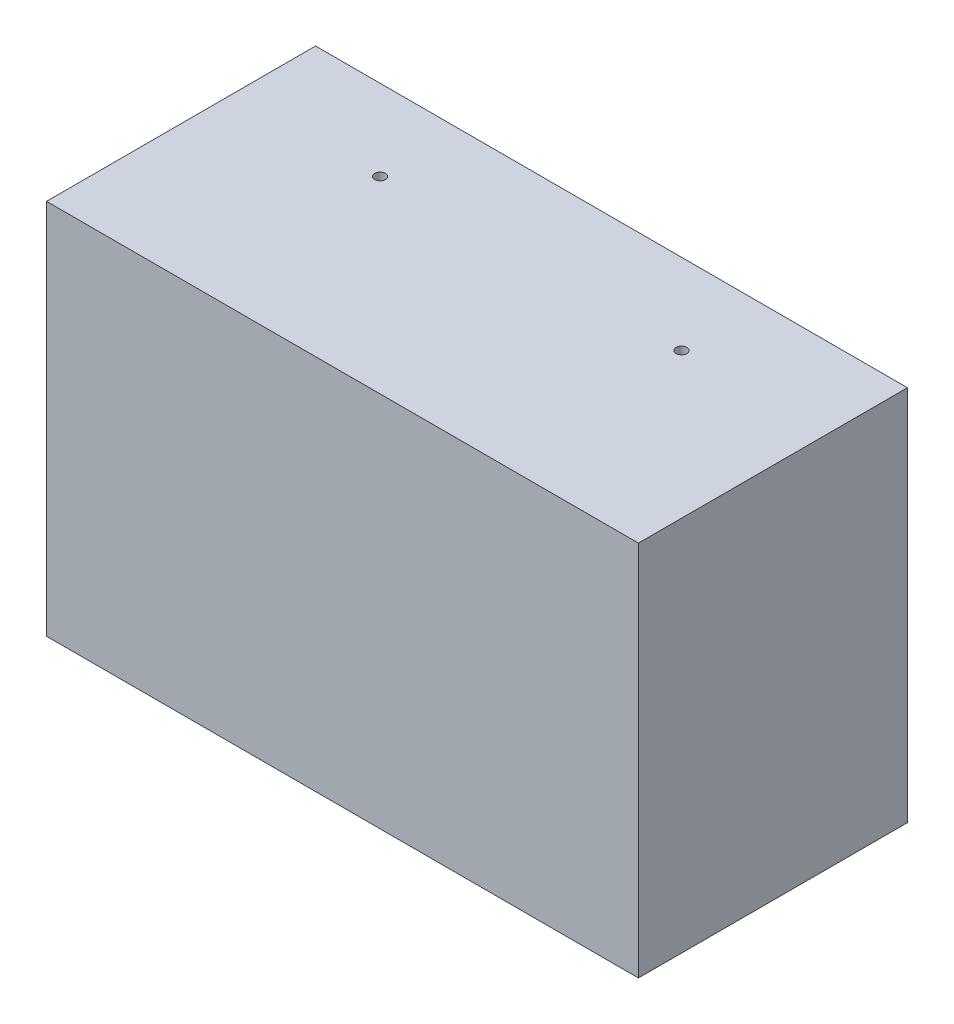
ISO-10303-21;
HEADER;
FILE_DESCRIPTION(('STEP AP214'),'2;1');
FILE_NAME('part.step','',(''),(''),'','','');
FILE_SCHEMA(('AUTOMOTIVE_DESIGN { 1 0 10303 214 1 1 1 1 }'));
ENDSEC;
DATA;
#1=APPLICATION_CONTEXT('core data for automotive mechanical design processes');
#2=APPLICATION_PROTOCOL_DEFINITION('international standard','automotive_design',2000,#1);
#3=PRODUCT_CONTEXT('',#1,'mechanical');
#4=PRODUCT('Part','Part','',(#3));
#5=PRODUCT_RELATED_PRODUCT_CATEGORY('part','',(#4));
#6=PRODUCT_DEFINITION_FORMATION('','',#4);
#7=PRODUCT_DEFINITION_CONTEXT('part definition',#1,'design');
#8=PRODUCT_DEFINITION('design','',#6,#7);
#9=PRODUCT_DEFINITION_SHAPE('','',#8);
#10=(LENGTH_UNIT() NAMED_UNIT(*) SI_UNIT(.MILLI.,.METRE.));
#11=(NAMED_UNIT(*) PLANE_ANGLE_UNIT() SI_UNIT($,.RADIAN.));
#12=(NAMED_UNIT(*) SI_UNIT($,.STERADIAN.) SOLID_ANGLE_UNIT());
#13=UNCERTAINTY_MEASURE_WITH_UNIT(LENGTH_MEASURE(1.E-05),#10,'distance_accuracy_value','');
#14=(GEOMETRIC_REPRESENTATION_CONTEXT(3) GLOBAL_UNCERTAINTY_ASSIGNED_CONTEXT((#13)) GLOBAL_UNIT_ASSIGNED_CONTEXT((#10,
#11,#12)) REPRESENTATION_CONTEXT('',''));
#15=CARTESIAN_POINT('',(0.,0.,0.));
#16=DIRECTION('',(0.,0.,1.));
#17=DIRECTION('',(1.,0.,0.));
#18=AXIS2_PLACEMENT_3D('',#15,#16,#17);
#19=CARTESIAN_POINT('',(-55.,-35.,50.));
#20=DIRECTION('',(0.,1.,0.));
#21=DIRECTION('',(0.,0.,1.));
#22=AXIS2_PLACEMENT_3D('',#19,#20,#21);
#23=PLANE('',#22);
#24=CARTESIAN_POINT('',(28.,-35.,15.));
#25=DIRECTION('',(0.,1.,0.));
#26=DIRECTION('',(0.,0.,1.));
#27=AXIS2_PLACEMENT_3D('',#24,#25,#26);
#28=CIRCLE('',#27,0.999999999999998);
#29=CARTESIAN_POINT('',(28.,-35.,16.));
#30=VERTEX_POINT('',#29);
#31=EDGE_CURVE('E176',#30,#30,#28,.F.);
#32=ORIENTED_EDGE('',*,*,#31,.F.);
#33=EDGE_LOOP('',(#32));
#34=FACE_BOUND('',#33,.T.);
#35=DIRECTION('',(1.,0.,0.));
#36=VECTOR('',#35,1.);
#37=CARTESIAN_POINT('',(-55.,-35.,0.));
#38=LINE('',#37,#36);
#39=CARTESIAN_POINT('',(-55.,-35.,0.));
#40=VERTEX_POINT('',#39);
#41=CARTESIAN_POINT('',(55.,-35.,0.));
#42=VERTEX_POINT('',#41);
#43=EDGE_CURVE('E134',#40,#42,#38,.T.);
#44=ORIENTED_EDGE('',*,*,#43,.T.);
#45=DIRECTION('',(0.,0.,-1.));
#46=VECTOR('',#45,1.);
#47=CARTESIAN_POINT('',(55.,-35.,50.));
#48=LINE('',#47,#46);
#49=CARTESIAN_POINT('',(55.,-35.,50.));
#50=VERTEX_POINT('',#49);
#51=EDGE_CURVE('E42',#50,#42,#48,.T.);
#52=ORIENTED_EDGE('',*,*,#51,.F.);
#53=DIRECTION('',(1.,0.,0.));
#54=VECTOR('',#53,1.);
#55=CARTESIAN_POINT('',(-55.,-35.,50.));
#56=LINE('',#55,#54);
#57=CARTESIAN_POINT('',(-55.,-35.,50.));
#58=VERTEX_POINT('',#57);
#59=EDGE_CURVE('E87',#58,#50,#56,.T.);
#60=ORIENTED_EDGE('',*,*,#59,.F.);
#61=DIRECTION('',(0.,0.,-1.));
#62=VECTOR('',#61,1.);
#63=CARTESIAN_POINT('',(-55.,-35.,50.));
#64=LINE('',#63,#62);
#65=EDGE_CURVE('E11',#58,#40,#64,.T.);
#66=ORIENTED_EDGE('',*,*,#65,.T.);
#67=EDGE_LOOP('',(#44,#52,#60,#66));
#68=FACE_BOUND('',#67,.T.);
#69=CARTESIAN_POINT('',(-28.,-35.,15.));
#70=DIRECTION('',(0.,1.,0.));
#71=DIRECTION('',(0.,0.,1.));
#72=AXIS2_PLACEMENT_3D('',#69,#70,#71);
#73=CIRCLE('',#72,0.999999999999998);
#74=CARTESIAN_POINT('',(-28.,-35.,16.));
#75=VERTEX_POINT('',#74);
#76=EDGE_CURVE('E158',#75,#75,#73,.F.);
#77=ORIENTED_EDGE('',*,*,#76,.F.);
#78=EDGE_LOOP('',(#77));
#79=FACE_BOUND('',#78,.T.);
#80=ADVANCED_FACE('F33',(#34,#68,#79),#23,.F.);
#81=CARTESIAN_POINT('',(-55.,35.,50.));
#82=DIRECTION('',(0.,-1.,0.));
#83=DIRECTION('',(0.,0.,-1.));
#84=AXIS2_PLACEMENT_3D('',#81,#82,#83);
#85=PLANE('',#84);
#86=CARTESIAN_POINT('',(28.,35.,15.));
#87=DIRECTION('',(0.,-1.,0.));
#88=DIRECTION('',(0.,0.,-1.));
#89=AXIS2_PLACEMENT_3D('',#86,#87,#88);
#90=CIRCLE('',#89,0.999999999999998);
#91=CARTESIAN_POINT('',(28.,35.,14.));
#92=VERTEX_POINT('',#91);
#93=EDGE_CURVE('E162',#92,#92,#90,.F.);
#94=ORIENTED_EDGE('',*,*,#93,.F.);
#95=EDGE_LOOP('',(#94));
#96=FACE_BOUND('',#95,.T.);
#97=DIRECTION('',(-1.,0.,0.));
#98=VECTOR('',#97,1.);
#99=CARTESIAN_POINT('',(-55.,35.,0.));
#100=LINE('',#99,#98);
#101=CARTESIAN_POINT('',(55.,35.,0.));
#102=VERTEX_POINT('',#101);
#103=CARTESIAN_POINT('',(-55.,35.,0.));
#104=VERTEX_POINT('',#103);
#105=EDGE_CURVE('E80',#102,#104,#100,.T.);
#106=ORIENTED_EDGE('',*,*,#105,.T.);
#107=DIRECTION('',(0.,0.,-1.));
#108=VECTOR('',#107,1.);
#109=CARTESIAN_POINT('',(-55.,35.,50.));
#110=LINE('',#109,#108);
#111=CARTESIAN_POINT('',(-55.,35.,50.));
#112=VERTEX_POINT('',#111);
#113=EDGE_CURVE('E145',#112,#104,#110,.T.);
#114=ORIENTED_EDGE('',*,*,#113,.F.);
#115=DIRECTION('',(-1.,0.,0.));
#116=VECTOR('',#115,1.);
#117=CARTESIAN_POINT('',(-55.,35.,50.));
#118=LINE('',#117,#116);
#119=CARTESIAN_POINT('',(55.,35.,50.));
#120=VERTEX_POINT('',#119);
#121=EDGE_CURVE('E59',#120,#112,#118,.T.);
#122=ORIENTED_EDGE('',*,*,#121,.F.);
#123=DIRECTION('',(0.,0.,-1.));
#124=VECTOR('',#123,1.);
#125=CARTESIAN_POINT('',(55.,35.,50.));
#126=LINE('',#125,#124);
#127=EDGE_CURVE('E152',#120,#102,#126,.T.);
#128=ORIENTED_EDGE('',*,*,#127,.T.);
#129=EDGE_LOOP('',(#106,#114,#122,#128));
#130=FACE_BOUND('',#129,.T.);
#131=CARTESIAN_POINT('',(-28.,35.,15.));
#132=DIRECTION('',(0.,-1.,0.));
#133=DIRECTION('',(0.,0.,-1.));
#134=AXIS2_PLACEMENT_3D('',#131,#132,#133);
#135=CIRCLE('',#134,0.999999999999998);
#136=CARTESIAN_POINT('',(-28.,35.,14.));
#137=VERTEX_POINT('',#136);
#138=EDGE_CURVE('E165',#137,#137,#135,.F.);
#139=ORIENTED_EDGE('',*,*,#138,.F.);
#140=EDGE_LOOP('',(#139));
#141=FACE_BOUND('',#140,.T.);
#142=ADVANCED_FACE('F213',(#96,#130,#141),#85,.F.);
#143=CARTESIAN_POINT('',(50.,30.,35.));
#144=DIRECTION('',(0.,-1.,0.));
#145=DIRECTION('',(1.,0.,0.));
#146=AXIS2_PLACEMENT_3D('',#143,#144,#145);
#147=PLANE('',#146);
#148=CARTESIAN_POINT('',(28.,30.,15.));
#149=DIRECTION('',(0.,-1.,0.));
#150=DIRECTION('',(1.,0.,0.));
#151=AXIS2_PLACEMENT_3D('',#148,#149,#150);
#152=CIRCLE('',#151,0.999999999999998);
#153=CARTESIAN_POINT('',(29.,30.,15.));
#154=VERTEX_POINT('',#153);
#155=EDGE_CURVE('E157',#154,#154,#152,.F.);
#156=ORIENTED_EDGE('',*,*,#155,.T.);
#157=EDGE_LOOP('',(#156));
#158=FACE_BOUND('',#157,.T.);
#159=DIRECTION('',(-1.,0.,0.));
#160=VECTOR('',#159,1.);
#161=CARTESIAN_POINT('',(50.,30.,0.));
#162=LINE('',#161,#160);
#163=CARTESIAN_POINT('',(50.,30.,0.));
#164=VERTEX_POINT('',#163);
#165=CARTESIAN_POINT('',(-50.,30.,0.));
#166=VERTEX_POINT('',#165);
#167=EDGE_CURVE('E129',#164,#166,#162,.T.);
#168=ORIENTED_EDGE('',*,*,#167,.F.);
#169=DIRECTION('',(0.,0.,-1.));
#170=VECTOR('',#169,1.);
#171=CARTESIAN_POINT('',(50.,30.,35.));
#172=LINE('',#171,#170);
#173=CARTESIAN_POINT('',(50.,30.,35.));
#174=VERTEX_POINT('',#173);
#175=EDGE_CURVE('E122',#174,#164,#172,.T.);
#176=ORIENTED_EDGE('',*,*,#175,.F.);
#177=DIRECTION('',(-1.,0.,0.));
#178=VECTOR('',#177,1.);
#179=CARTESIAN_POINT('',(50.,30.,35.));
#180=LINE('',#179,#178);
#181=CARTESIAN_POINT('',(-50.,30.,35.));
#182=VERTEX_POINT('',#181);
#183=EDGE_CURVE('E111',#174,#182,#180,.T.);
#184=ORIENTED_EDGE('',*,*,#183,.T.);
#185=DIRECTION('',(0.,0.,-1.));
#186=VECTOR('',#185,1.);
#187=CARTESIAN_POINT('',(-50.,30.,35.));
#188=LINE('',#187,#186);
#189=EDGE_CURVE('E131',#182,#166,#188,.T.);
#190=ORIENTED_EDGE('',*,*,#189,.T.);
#191=EDGE_LOOP('',(#168,#176,#184,#190));
#192=FACE_BOUND('',#191,.T.);
#193=CARTESIAN_POINT('',(-28.,30.,15.));
#194=DIRECTION('',(0.,-1.,0.));
#195=DIRECTION('',(1.,0.,0.));
#196=AXIS2_PLACEMENT_3D('',#193,#194,#195);
#197=CIRCLE('',#196,0.999999999999998);
#198=CARTESIAN_POINT('',(-27.,30.,15.));
#199=VERTEX_POINT('',#198);
#200=EDGE_CURVE('E170',#199,#199,#197,.F.);
#201=ORIENTED_EDGE('',*,*,#200,.T.);
#202=EDGE_LOOP('',(#201));
#203=FACE_BOUND('',#202,.T.);
#204=ADVANCED_FACE('F126',(#158,#192,#203),#147,.T.);
#205=CARTESIAN_POINT('',(50.,-30.,35.));
#206=DIRECTION('',(0.,1.,0.));
#207=DIRECTION('',(-1.,0.,0.));
#208=AXIS2_PLACEMENT_3D('',#205,#206,#207);
#209=PLANE('',#208);
#210=CARTESIAN_POINT('',(28.,-30.,15.));
#211=DIRECTION('',(0.,1.,0.));
#212=DIRECTION('',(-1.,0.,0.));
#213=AXIS2_PLACEMENT_3D('',#210,#211,#212);
#214=CIRCLE('',#213,0.999999999999998);
#215=CARTESIAN_POINT('',(27.,-30.,15.));
#216=VERTEX_POINT('',#215);
#217=EDGE_CURVE('E155',#216,#216,#214,.F.);
#218=ORIENTED_EDGE('',*,*,#217,.T.);
#219=EDGE_LOOP('',(#218));
#220=FACE_BOUND('',#219,.T.);
#221=DIRECTION('',(1.,0.,0.));
#222=VECTOR('',#221,1.);
#223=CARTESIAN_POINT('',(50.,-30.,0.));
#224=LINE('',#223,#222);
#225=CARTESIAN_POINT('',(-50.,-30.,0.));
#226=VERTEX_POINT('',#225);
#227=CARTESIAN_POINT('',(50.,-30.,0.));
#228=VERTEX_POINT('',#227);
#229=EDGE_CURVE('E124',#226,#228,#224,.T.);
#230=ORIENTED_EDGE('',*,*,#229,.F.);
#231=DIRECTION('',(0.,0.,-1.));
#232=VECTOR('',#231,1.);
#233=CARTESIAN_POINT('',(-50.,-30.,35.));
#234=LINE('',#233,#232);
#235=CARTESIAN_POINT('',(-50.,-30.,35.));
#236=VERTEX_POINT('',#235);
#237=EDGE_CURVE('E136',#236,#226,#234,.T.);
#238=ORIENTED_EDGE('',*,*,#237,.F.);
#239=DIRECTION('',(1.,0.,0.));
#240=VECTOR('',#239,1.);
#241=CARTESIAN_POINT('',(50.,-30.,35.));
#242=LINE('',#241,#240);
#243=CARTESIAN_POINT('',(50.,-30.,35.));
#244=VERTEX_POINT('',#243);
#245=EDGE_CURVE('E180',#236,#244,#242,.T.);
#246=ORIENTED_EDGE('',*,*,#245,.T.);
#247=DIRECTION('',(0.,0.,-1.));
#248=VECTOR('',#247,1.);
#249=CARTESIAN_POINT('',(50.,-30.,35.));
#250=LINE('',#249,#248);
#251=EDGE_CURVE('E123',#244,#228,#250,.T.);
#252=ORIENTED_EDGE('',*,*,#251,.T.);
#253=EDGE_LOOP('',(#230,#238,#246,#252));
#254=FACE_BOUND('',#253,.T.);
#255=CARTESIAN_POINT('',(-28.,-30.,15.));
#256=DIRECTION('',(0.,1.,0.));
#257=DIRECTION('',(-1.,0.,0.));
#258=AXIS2_PLACEMENT_3D('',#255,#256,#257);
#259=CIRCLE('',#258,0.999999999999998);
#260=CARTESIAN_POINT('',(-29.,-30.,15.));
#261=VERTEX_POINT('',#260);
#262=EDGE_CURVE('E37',#261,#261,#259,.F.);
#263=ORIENTED_EDGE('',*,*,#262,.T.);
#264=EDGE_LOOP('',(#263));
#265=FACE_BOUND('',#264,.T.);
#266=ADVANCED_FACE('F195',(#220,#254,#265),#209,.T.);
#267=CARTESIAN_POINT('',(0.,0.,0.));
#268=DIRECTION('',(0.,0.,1.));
#269=DIRECTION('',(1.,0.,0.));
#270=AXIS2_PLACEMENT_3D('',#267,#268,#269);
#271=PLANE('',#270);
#272=DIRECTION('',(0.,-1.,0.));
#273=VECTOR('',#272,1.);
#274=CARTESIAN_POINT('',(-55.,35.,0.));
#275=LINE('',#274,#273);
#276=EDGE_CURVE('E130',#104,#40,#275,.T.);
#277=ORIENTED_EDGE('',*,*,#276,.F.);
#278=ORIENTED_EDGE('',*,*,#105,.F.);
#279=DIRECTION('',(0.,1.,0.));
#280=VECTOR('',#279,1.);
#281=CARTESIAN_POINT('',(55.,35.,0.));
#282=LINE('',#281,#280);
#283=EDGE_CURVE('E148',#42,#102,#282,.T.);
#284=ORIENTED_EDGE('',*,*,#283,.F.);
#285=ORIENTED_EDGE('',*,*,#43,.F.);
#286=EDGE_LOOP('',(#277,#278,#284,#285));
#287=FACE_BOUND('',#286,.T.);
#288=DIRECTION('',(0.,1.,0.));
#289=VECTOR('',#288,1.);
#290=CARTESIAN_POINT('',(50.,30.,0.));
#291=LINE('',#290,#289);
#292=EDGE_CURVE('E50',#228,#164,#291,.T.);
#293=ORIENTED_EDGE('',*,*,#292,.T.);
#294=ORIENTED_EDGE('',*,*,#167,.T.);
#295=DIRECTION('',(0.,-1.,0.));
#296=VECTOR('',#295,1.);
#297=CARTESIAN_POINT('',(-50.,30.,0.));
#298=LINE('',#297,#296);
#299=EDGE_CURVE('E184',#166,#226,#298,.T.);
#300=ORIENTED_EDGE('',*,*,#299,.T.);
#301=ORIENTED_EDGE('',*,*,#229,.T.);
#302=EDGE_LOOP('',(#293,#294,#300,#301));
#303=FACE_BOUND('',#302,.T.);
#304=ADVANCED_FACE('F198',(#287,#303),#271,.F.);
#305=CARTESIAN_POINT('',(-55.,35.,50.));
#306=DIRECTION('',(1.,0.,0.));
#307=DIRECTION('',(0.,0.,-1.));
#308=AXIS2_PLACEMENT_3D('',#305,#306,#307);
#309=PLANE('',#308);
#310=ORIENTED_EDGE('',*,*,#276,.T.);
#311=ORIENTED_EDGE('',*,*,#65,.F.);
#312=DIRECTION('',(0.,-1.,0.));
#313=VECTOR('',#312,1.);
#314=CARTESIAN_POINT('',(-55.,35.,50.));
#315=LINE('',#314,#313);
#316=EDGE_CURVE('E140',#112,#58,#315,.T.);
#317=ORIENTED_EDGE('',*,*,#316,.F.);
#318=ORIENTED_EDGE('',*,*,#113,.T.);
#319=EDGE_LOOP('',(#310,#311,#317,#318));
#320=FACE_BOUND('',#319,.T.);
#321=ADVANCED_FACE('F35',(#320),#309,.F.);
#322=CARTESIAN_POINT('',(55.,35.,50.));
#323=DIRECTION('',(-1.,0.,0.));
#324=DIRECTION('',(0.,-1.,0.));
#325=AXIS2_PLACEMENT_3D('',#322,#323,#324);
#326=PLANE('',#325);
#327=ORIENTED_EDGE('',*,*,#283,.T.);
#328=ORIENTED_EDGE('',*,*,#127,.F.);
#329=DIRECTION('',(0.,1.,0.));
#330=VECTOR('',#329,1.);
#331=CARTESIAN_POINT('',(55.,35.,50.));
#332=LINE('',#331,#330);
#333=EDGE_CURVE('E143',#50,#120,#332,.T.);
#334=ORIENTED_EDGE('',*,*,#333,.F.);
#335=ORIENTED_EDGE('',*,*,#51,.T.);
#336=EDGE_LOOP('',(#327,#328,#334,#335));
#337=FACE_BOUND('',#336,.T.);
#338=ADVANCED_FACE('F205',(#337),#326,.F.);
#339=CARTESIAN_POINT('',(0.,0.,50.));
#340=DIRECTION('',(0.,0.,1.));
#341=DIRECTION('',(1.,0.,0.));
#342=AXIS2_PLACEMENT_3D('',#339,#340,#341);
#343=PLANE('',#342);
#344=ORIENTED_EDGE('',*,*,#316,.T.);
#345=ORIENTED_EDGE('',*,*,#59,.T.);
#346=ORIENTED_EDGE('',*,*,#333,.T.);
#347=ORIENTED_EDGE('',*,*,#121,.T.);
#348=EDGE_LOOP('',(#344,#345,#346,#347));
#349=FACE_BOUND('',#348,.T.);
#350=ADVANCED_FACE('F223',(#349),#343,.T.);
#351=CARTESIAN_POINT('',(50.,30.,35.));
#352=DIRECTION('',(-1.,0.,0.));
#353=DIRECTION('',(0.,-1.,0.));
#354=AXIS2_PLACEMENT_3D('',#351,#352,#353);
#355=PLANE('',#354);
#356=ORIENTED_EDGE('',*,*,#292,.F.);
#357=ORIENTED_EDGE('',*,*,#251,.F.);
#358=DIRECTION('',(0.,1.,0.));
#359=VECTOR('',#358,1.);
#360=CARTESIAN_POINT('',(50.,30.,35.));
#361=LINE('',#360,#359);
#362=EDGE_CURVE('E115',#244,#174,#361,.T.);
#363=ORIENTED_EDGE('',*,*,#362,.T.);
#364=ORIENTED_EDGE('',*,*,#175,.T.);
#365=EDGE_LOOP('',(#356,#357,#363,#364));
#366=FACE_BOUND('',#365,.T.);
#367=ADVANCED_FACE('F121',(#366),#355,.T.);
#368=CARTESIAN_POINT('',(-50.,30.,35.));
#369=DIRECTION('',(1.,0.,0.));
#370=DIRECTION('',(0.,1.,0.));
#371=AXIS2_PLACEMENT_3D('',#368,#369,#370);
#372=PLANE('',#371);
#373=ORIENTED_EDGE('',*,*,#299,.F.);
#374=ORIENTED_EDGE('',*,*,#189,.F.);
#375=DIRECTION('',(0.,-1.,0.));
#376=VECTOR('',#375,1.);
#377=CARTESIAN_POINT('',(-50.,30.,35.));
#378=LINE('',#377,#376);
#379=EDGE_CURVE('E116',#182,#236,#378,.T.);
#380=ORIENTED_EDGE('',*,*,#379,.T.);
#381=ORIENTED_EDGE('',*,*,#237,.T.);
#382=EDGE_LOOP('',(#373,#374,#380,#381));
#383=FACE_BOUND('',#382,.T.);
#384=ADVANCED_FACE('F193',(#383),#372,.T.);
#385=CARTESIAN_POINT('',(0.,0.,35.));
#386=DIRECTION('',(0.,0.,-1.));
#387=DIRECTION('',(-1.,0.,0.));
#388=AXIS2_PLACEMENT_3D('',#385,#386,#387);
#389=PLANE('',#388);
#390=ORIENTED_EDGE('',*,*,#362,.F.);
#391=ORIENTED_EDGE('',*,*,#245,.F.);
#392=ORIENTED_EDGE('',*,*,#379,.F.);
#393=ORIENTED_EDGE('',*,*,#183,.F.);
#394=EDGE_LOOP('',(#390,#391,#392,#393));
#395=FACE_BOUND('',#394,.T.);
#396=ADVANCED_FACE('F113',(#395),#389,.T.);
#397=CARTESIAN_POINT('',(28.,40.,15.));
#398=DIRECTION('',(0.,-1.,0.));
#399=DIRECTION('',(0.,0.,-1.));
#400=AXIS2_PLACEMENT_3D('',#397,#398,#399);
#401=CYLINDRICAL_SURFACE('',#400,0.999999999999998);
#402=ORIENTED_EDGE('',*,*,#217,.F.);
#403=EDGE_LOOP('',(#402));
#404=FACE_BOUND('',#403,.T.);
#405=ORIENTED_EDGE('',*,*,#31,.T.);
#406=EDGE_LOOP('',(#405));
#407=FACE_BOUND('',#406,.T.);
#408=ADVANCED_FACE('F249',(#404,#407),#401,.F.);
#409=ORIENTED_EDGE('',*,*,#155,.F.);
#410=EDGE_LOOP('',(#409));
#411=FACE_BOUND('',#410,.T.);
#412=ORIENTED_EDGE('',*,*,#93,.T.);
#413=EDGE_LOOP('',(#412));
#414=FACE_BOUND('',#413,.T.);
#415=ADVANCED_FACE('F245',(#411,#414),#401,.F.);
#416=CARTESIAN_POINT('',(-28.,40.,15.));
#417=DIRECTION('',(0.,-1.,0.));
#418=DIRECTION('',(0.,0.,-1.));
#419=AXIS2_PLACEMENT_3D('',#416,#417,#418);
#420=CYLINDRICAL_SURFACE('',#419,0.999999999999998);
#421=ORIENTED_EDGE('',*,*,#262,.F.);
#422=EDGE_LOOP('',(#421));
#423=FACE_BOUND('',#422,.T.);
#424=ORIENTED_EDGE('',*,*,#76,.T.);
#425=EDGE_LOOP('',(#424));
#426=FACE_BOUND('',#425,.T.);
#427=ADVANCED_FACE('F239',(#423,#426),#420,.F.);
#428=ORIENTED_EDGE('',*,*,#200,.F.);
#429=EDGE_LOOP('',(#428));
#430=FACE_BOUND('',#429,.T.);
#431=ORIENTED_EDGE('',*,*,#138,.T.);
#432=EDGE_LOOP('',(#431));
#433=FACE_BOUND('',#432,.T.);
#434=ADVANCED_FACE('F237',(#430,#433),#420,.F.);
#435=CLOSED_SHELL('',(#80,#142,#204,#266,#304,#321,#338,#350,#367,#384,#396,#408,#415,#427,#434));
#436=MANIFOLD_SOLID_BREP('B2',#435);
#437=ADVANCED_BREP_SHAPE_REPRESENTATION('',(#18,#436),#14);
#438=SHAPE_DEFINITION_REPRESENTATION(#9,#437);
ENDSEC;
END-ISO-10303-21;
